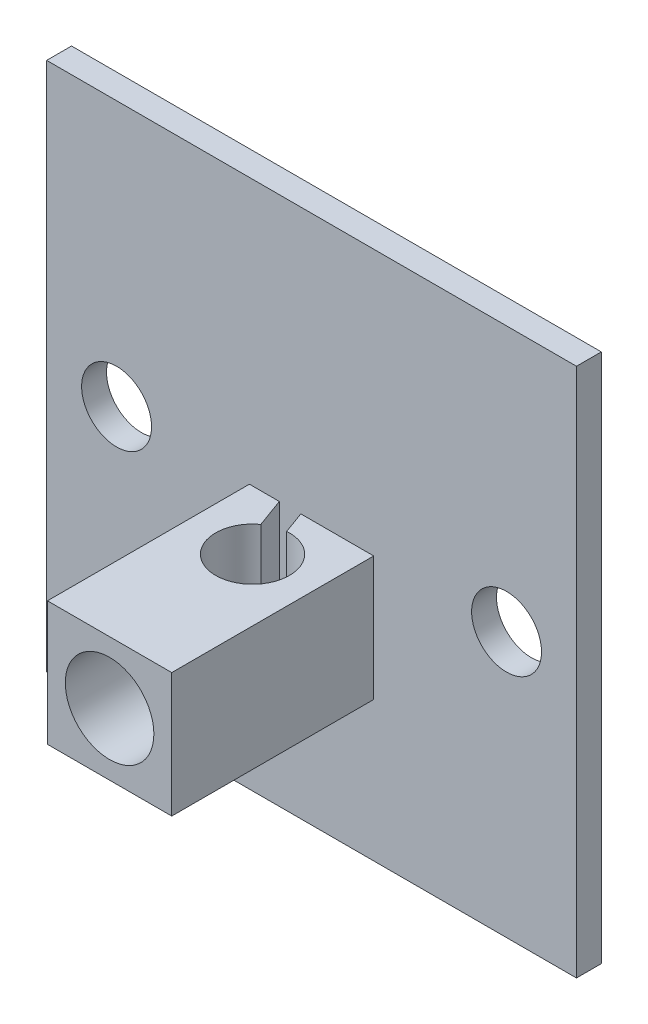
ISO-10303-21;
HEADER;
FILE_DESCRIPTION(('STEP AP214'),'2;1');
FILE_NAME('part.step','',(''),(''),'','','');
FILE_SCHEMA(('AUTOMOTIVE_DESIGN { 1 0 10303 214 1 1 1 1 }'));
ENDSEC;
DATA;
#1=APPLICATION_CONTEXT('core data for automotive mechanical design processes');
#2=APPLICATION_PROTOCOL_DEFINITION('international standard','automotive_design',2000,#1);
#3=PRODUCT_CONTEXT('',#1,'mechanical');
#4=PRODUCT('Part','Part','',(#3));
#5=PRODUCT_RELATED_PRODUCT_CATEGORY('part','',(#4));
#6=PRODUCT_DEFINITION_FORMATION('','',#4);
#7=PRODUCT_DEFINITION_CONTEXT('part definition',#1,'design');
#8=PRODUCT_DEFINITION('design','',#6,#7);
#9=PRODUCT_DEFINITION_SHAPE('','',#8);
#10=(LENGTH_UNIT() NAMED_UNIT(*) SI_UNIT(.MILLI.,.METRE.));
#11=(NAMED_UNIT(*) PLANE_ANGLE_UNIT() SI_UNIT($,.RADIAN.));
#12=(NAMED_UNIT(*) SI_UNIT($,.STERADIAN.) SOLID_ANGLE_UNIT());
#13=UNCERTAINTY_MEASURE_WITH_UNIT(LENGTH_MEASURE(1.E-05),#10,'distance_accuracy_value','');
#14=(GEOMETRIC_REPRESENTATION_CONTEXT(3) GLOBAL_UNCERTAINTY_ASSIGNED_CONTEXT((#13)) GLOBAL_UNIT_ASSIGNED_CONTEXT((#10,
#11,#12)) REPRESENTATION_CONTEXT('',''));
#15=CARTESIAN_POINT('',(0.,0.,0.));
#16=DIRECTION('',(0.,0.,1.));
#17=DIRECTION('',(1.,0.,0.));
#18=AXIS2_PLACEMENT_3D('',#15,#16,#17);
#19=CARTESIAN_POINT('',(0.,0.,1.6));
#20=DIRECTION('',(0.,0.,1.));
#21=DIRECTION('',(1.,0.,0.));
#22=AXIS2_PLACEMENT_3D('',#19,#20,#21);
#23=PLANE('',#22);
#24=DIRECTION('',(0.,1.,0.));
#25=VECTOR('',#24,1.);
#26=CARTESIAN_POINT('',(4.,-0.049999999999998,1.6));
#27=LINE('',#26,#25);
#28=CARTESIAN_POINT('',(4.,-8.05,1.6));
#29=VERTEX_POINT('',#28);
#30=CARTESIAN_POINT('',(4.,-0.049999999999998,1.6));
#31=VERTEX_POINT('',#30);
#32=EDGE_CURVE('E158',#29,#31,#27,.T.);
#33=ORIENTED_EDGE('',*,*,#32,.F.);
#34=DIRECTION('',(-1.,0.,0.));
#35=VECTOR('',#34,1.);
#36=CARTESIAN_POINT('',(17.05,-8.04999999999999,1.6));
#37=LINE('',#36,#35);
#38=CARTESIAN_POINT('',(-0.691371338102213,-8.05,1.6));
#39=VERTEX_POINT('',#38);
#40=EDGE_CURVE('E458',#29,#39,#37,.T.);
#41=ORIENTED_EDGE('',*,*,#40,.T.);
#42=DIRECTION('',(0.,1.,0.));
#43=VECTOR('',#42,1.);
#44=CARTESIAN_POINT('',(-0.691371338102214,-12.05,1.6));
#45=LINE('',#44,#43);
#46=CARTESIAN_POINT('',(-0.691371338102214,-0.049999999999998,1.6));
#47=VERTEX_POINT('',#46);
#48=EDGE_CURVE('E441',#39,#47,#45,.T.);
#49=ORIENTED_EDGE('',*,*,#48,.T.);
#50=DIRECTION('',(-1.,0.,0.));
#51=VECTOR('',#50,1.);
#52=CARTESIAN_POINT('',(-4.,-0.049999999999998,1.6));
#53=LINE('',#52,#51);
#54=EDGE_CURVE('E145',#31,#47,#53,.T.);
#55=ORIENTED_EDGE('',*,*,#54,.F.);
#56=EDGE_LOOP('',(#33,#41,#49,#55));
#57=FACE_BOUND('',#56,.T.);
#58=DIRECTION('',(0.,1.,0.));
#59=VECTOR('',#58,1.);
#60=CARTESIAN_POINT('',(-2.0748024423209,-12.05,1.6));
#61=LINE('',#60,#59);
#62=CARTESIAN_POINT('',(-2.0748024423209,-8.05,1.6));
#63=VERTEX_POINT('',#62);
#64=CARTESIAN_POINT('',(-2.0748024423209,-0.049999999999998,1.6));
#65=VERTEX_POINT('',#64);
#66=EDGE_CURVE('E439',#63,#65,#61,.T.);
#67=ORIENTED_EDGE('',*,*,#66,.F.);
#68=CARTESIAN_POINT('',(-4.,-8.05,1.6));
#69=VERTEX_POINT('',#68);
#70=EDGE_CURVE('E129',#63,#69,#37,.T.);
#71=ORIENTED_EDGE('',*,*,#70,.T.);
#72=DIRECTION('',(0.,-1.,0.));
#73=VECTOR('',#72,1.);
#74=CARTESIAN_POINT('',(-4.,-0.049999999999998,1.6));
#75=LINE('',#74,#73);
#76=CARTESIAN_POINT('',(-4.,-0.049999999999998,1.6));
#77=VERTEX_POINT('',#76);
#78=EDGE_CURVE('E137',#77,#69,#75,.T.);
#79=ORIENTED_EDGE('',*,*,#78,.F.);
#80=EDGE_CURVE('E149',#65,#77,#53,.T.);
#81=ORIENTED_EDGE('',*,*,#80,.F.);
#82=EDGE_LOOP('',(#67,#71,#79,#81));
#83=FACE_BOUND('',#82,.T.);
#84=DIRECTION('',(0.,1.,0.));
#85=VECTOR('',#84,1.);
#86=CARTESIAN_POINT('',(17.05,17.05,1.6));
#87=LINE('',#86,#85);
#88=CARTESIAN_POINT('',(17.05,-17.05,1.6));
#89=VERTEX_POINT('',#88);
#90=CARTESIAN_POINT('',(17.05,17.05,1.6));
#91=VERTEX_POINT('',#90);
#92=EDGE_CURVE('E183',#89,#91,#87,.T.);
#93=ORIENTED_EDGE('',*,*,#92,.T.);
#94=DIRECTION('',(-1.,0.,0.));
#95=VECTOR('',#94,1.);
#96=CARTESIAN_POINT('',(-17.05,17.05,1.6));
#97=LINE('',#96,#95);
#98=CARTESIAN_POINT('',(-17.05,17.05,1.6));
#99=VERTEX_POINT('',#98);
#100=EDGE_CURVE('E185',#91,#99,#97,.T.);
#101=ORIENTED_EDGE('',*,*,#100,.T.);
#102=DIRECTION('',(0.,-1.,0.));
#103=VECTOR('',#102,1.);
#104=CARTESIAN_POINT('',(-17.05,17.05,1.6));
#105=LINE('',#104,#103);
#106=CARTESIAN_POINT('',(-17.05,-17.05,1.6));
#107=VERTEX_POINT('',#106);
#108=EDGE_CURVE('E177',#99,#107,#105,.T.);
#109=ORIENTED_EDGE('',*,*,#108,.T.);
#110=DIRECTION('',(1.,0.,0.));
#111=VECTOR('',#110,1.);
#112=CARTESIAN_POINT('',(-17.05,-17.05,1.6));
#113=LINE('',#112,#111);
#114=EDGE_CURVE('E180',#107,#89,#113,.T.);
#115=ORIENTED_EDGE('',*,*,#114,.T.);
#116=EDGE_LOOP('',(#93,#101,#109,#115));
#117=FACE_BOUND('',#116,.T.);
#118=CARTESIAN_POINT('',(12.55,0.,1.6));
#119=DIRECTION('',(0.,0.,1.));
#120=DIRECTION('',(1.,0.,0.));
#121=AXIS2_PLACEMENT_3D('',#118,#119,#120);
#122=CIRCLE('',#121,2.25);
#123=CARTESIAN_POINT('',(14.8,0.,1.6));
#124=VERTEX_POINT('',#123);
#125=EDGE_CURVE('E171',#124,#124,#122,.T.);
#126=ORIENTED_EDGE('',*,*,#125,.F.);
#127=EDGE_LOOP('',(#126));
#128=FACE_BOUND('',#127,.T.);
#129=CARTESIAN_POINT('',(-12.55,0.,1.6));
#130=DIRECTION('',(0.,0.,1.));
#131=DIRECTION('',(1.,0.,0.));
#132=AXIS2_PLACEMENT_3D('',#129,#130,#131);
#133=CIRCLE('',#132,2.25);
#134=CARTESIAN_POINT('',(-10.3,0.,1.6));
#135=VERTEX_POINT('',#134);
#136=EDGE_CURVE('E165',#135,#135,#133,.T.);
#137=ORIENTED_EDGE('',*,*,#136,.F.);
#138=EDGE_LOOP('',(#137));
#139=FACE_BOUND('',#138,.T.);
#140=ADVANCED_FACE('F36',(#57,#83,#117,#128,#139),#23,.T.);
#141=CARTESIAN_POINT('',(0.,0.,0.));
#142=DIRECTION('',(0.,0.,1.));
#143=DIRECTION('',(1.,0.,0.));
#144=AXIS2_PLACEMENT_3D('',#141,#142,#143);
#145=PLANE('',#144);
#146=DIRECTION('',(0.,-1.,0.));
#147=VECTOR('',#146,1.);
#148=CARTESIAN_POINT('',(-17.05,17.05,0.));
#149=LINE('',#148,#147);
#150=CARTESIAN_POINT('',(-17.05,17.05,0.));
#151=VERTEX_POINT('',#150);
#152=CARTESIAN_POINT('',(-17.05,-17.05,0.));
#153=VERTEX_POINT('',#152);
#154=EDGE_CURVE('E174',#151,#153,#149,.T.);
#155=ORIENTED_EDGE('',*,*,#154,.F.);
#156=DIRECTION('',(-1.,0.,0.));
#157=VECTOR('',#156,1.);
#158=CARTESIAN_POINT('',(-17.05,17.05,0.));
#159=LINE('',#158,#157);
#160=CARTESIAN_POINT('',(17.05,17.05,0.));
#161=VERTEX_POINT('',#160);
#162=EDGE_CURVE('E181',#161,#151,#159,.T.);
#163=ORIENTED_EDGE('',*,*,#162,.F.);
#164=DIRECTION('',(0.,1.,0.));
#165=VECTOR('',#164,1.);
#166=CARTESIAN_POINT('',(17.05,17.05,0.));
#167=LINE('',#166,#165);
#168=CARTESIAN_POINT('',(17.05,-17.05,0.));
#169=VERTEX_POINT('',#168);
#170=EDGE_CURVE('E192',#169,#161,#167,.T.);
#171=ORIENTED_EDGE('',*,*,#170,.F.);
#172=DIRECTION('',(1.,0.,0.));
#173=VECTOR('',#172,1.);
#174=CARTESIAN_POINT('',(-17.05,-17.05,0.));
#175=LINE('',#174,#173);
#176=EDGE_CURVE('E190',#153,#169,#175,.T.);
#177=ORIENTED_EDGE('',*,*,#176,.F.);
#178=EDGE_LOOP('',(#155,#163,#171,#177));
#179=FACE_BOUND('',#178,.T.);
#180=CARTESIAN_POINT('',(12.55,0.,0.));
#181=DIRECTION('',(0.,0.,1.));
#182=DIRECTION('',(1.,0.,0.));
#183=AXIS2_PLACEMENT_3D('',#180,#181,#182);
#184=CIRCLE('',#183,2.25);
#185=CARTESIAN_POINT('',(14.8,0.,0.));
#186=VERTEX_POINT('',#185);
#187=EDGE_CURVE('E168',#186,#186,#184,.T.);
#188=ORIENTED_EDGE('',*,*,#187,.T.);
#189=EDGE_LOOP('',(#188));
#190=FACE_BOUND('',#189,.T.);
#191=CARTESIAN_POINT('',(-12.55,0.,0.));
#192=DIRECTION('',(0.,0.,1.));
#193=DIRECTION('',(1.,0.,0.));
#194=AXIS2_PLACEMENT_3D('',#191,#192,#193);
#195=CIRCLE('',#194,2.25);
#196=CARTESIAN_POINT('',(-10.3,0.,0.));
#197=VERTEX_POINT('',#196);
#198=EDGE_CURVE('E164',#197,#197,#195,.T.);
#199=ORIENTED_EDGE('',*,*,#198,.T.);
#200=EDGE_LOOP('',(#199));
#201=FACE_BOUND('',#200,.T.);
#202=ADVANCED_FACE('F213',(#179,#190,#201),#145,.F.);
#203=CARTESIAN_POINT('',(-17.05,17.05,1.6));
#204=DIRECTION('',(1.,0.,0.));
#205=DIRECTION('',(0.,0.,-1.));
#206=AXIS2_PLACEMENT_3D('',#203,#204,#205);
#207=PLANE('',#206);
#208=ORIENTED_EDGE('',*,*,#154,.T.);
#209=DIRECTION('',(0.,0.,-1.));
#210=VECTOR('',#209,1.);
#211=CARTESIAN_POINT('',(-17.05,-17.05,1.6));
#212=LINE('',#211,#210);
#213=EDGE_CURVE('E44',#107,#153,#212,.T.);
#214=ORIENTED_EDGE('',*,*,#213,.F.);
#215=ORIENTED_EDGE('',*,*,#108,.F.);
#216=DIRECTION('',(0.,0.,-1.));
#217=VECTOR('',#216,1.);
#218=CARTESIAN_POINT('',(-17.05,17.05,1.6));
#219=LINE('',#218,#217);
#220=EDGE_CURVE('E187',#99,#151,#219,.T.);
#221=ORIENTED_EDGE('',*,*,#220,.T.);
#222=EDGE_LOOP('',(#208,#214,#215,#221));
#223=FACE_BOUND('',#222,.T.);
#224=ADVANCED_FACE('F38',(#223),#207,.F.);
#225=CARTESIAN_POINT('',(-17.05,-17.05,1.6));
#226=DIRECTION('',(0.,1.,0.));
#227=DIRECTION('',(0.,0.,1.));
#228=AXIS2_PLACEMENT_3D('',#225,#226,#227);
#229=PLANE('',#228);
#230=DIRECTION('',(0.,0.,-1.));
#231=VECTOR('',#230,1.);
#232=CARTESIAN_POINT('',(17.05,-17.05,1.6));
#233=LINE('',#232,#231);
#234=EDGE_CURVE('E200',#89,#169,#233,.T.);
#235=ORIENTED_EDGE('',*,*,#234,.F.);
#236=ORIENTED_EDGE('',*,*,#114,.F.);
#237=ORIENTED_EDGE('',*,*,#213,.T.);
#238=ORIENTED_EDGE('',*,*,#176,.T.);
#239=EDGE_LOOP('',(#235,#236,#237,#238));
#240=FACE_BOUND('',#239,.T.);
#241=ADVANCED_FACE('F206',(#240),#229,.F.);
#242=CARTESIAN_POINT('',(17.05,17.05,1.6));
#243=DIRECTION('',(-1.,0.,0.));
#244=DIRECTION('',(0.,0.,1.));
#245=AXIS2_PLACEMENT_3D('',#242,#243,#244);
#246=PLANE('',#245);
#247=ORIENTED_EDGE('',*,*,#170,.T.);
#248=DIRECTION('',(0.,0.,-1.));
#249=VECTOR('',#248,1.);
#250=CARTESIAN_POINT('',(17.05,17.05,1.6));
#251=LINE('',#250,#249);
#252=EDGE_CURVE('E197',#91,#161,#251,.T.);
#253=ORIENTED_EDGE('',*,*,#252,.F.);
#254=ORIENTED_EDGE('',*,*,#92,.F.);
#255=ORIENTED_EDGE('',*,*,#234,.T.);
#256=EDGE_LOOP('',(#247,#253,#254,#255));
#257=FACE_BOUND('',#256,.T.);
#258=ADVANCED_FACE('F218',(#257),#246,.F.);
#259=CARTESIAN_POINT('',(-17.05,17.05,1.6));
#260=DIRECTION('',(0.,-1.,0.));
#261=DIRECTION('',(0.,0.,-1.));
#262=AXIS2_PLACEMENT_3D('',#259,#260,#261);
#263=PLANE('',#262);
#264=ORIENTED_EDGE('',*,*,#162,.T.);
#265=ORIENTED_EDGE('',*,*,#220,.F.);
#266=ORIENTED_EDGE('',*,*,#100,.F.);
#267=ORIENTED_EDGE('',*,*,#252,.T.);
#268=EDGE_LOOP('',(#264,#265,#266,#267));
#269=FACE_BOUND('',#268,.T.);
#270=ADVANCED_FACE('F222',(#269),#263,.F.);
#271=CARTESIAN_POINT('',(12.55,0.,1.6));
#272=DIRECTION('',(0.,0.,-1.));
#273=DIRECTION('',(-1.,0.,0.));
#274=AXIS2_PLACEMENT_3D('',#271,#272,#273);
#275=CYLINDRICAL_SURFACE('',#274,2.25);
#276=ORIENTED_EDGE('',*,*,#125,.T.);
#277=EDGE_LOOP('',(#276));
#278=FACE_BOUND('',#277,.T.);
#279=ORIENTED_EDGE('',*,*,#187,.F.);
#280=EDGE_LOOP('',(#279));
#281=FACE_BOUND('',#280,.T.);
#282=ADVANCED_FACE('F235',(#278,#281),#275,.F.);
#283=CARTESIAN_POINT('',(-12.55,0.,1.6));
#284=DIRECTION('',(0.,0.,-1.));
#285=DIRECTION('',(-1.,0.,0.));
#286=AXIS2_PLACEMENT_3D('',#283,#284,#285);
#287=CYLINDRICAL_SURFACE('',#286,2.25);
#288=ORIENTED_EDGE('',*,*,#136,.T.);
#289=EDGE_LOOP('',(#288));
#290=FACE_BOUND('',#289,.T.);
#291=ORIENTED_EDGE('',*,*,#198,.F.);
#292=EDGE_LOOP('',(#291));
#293=FACE_BOUND('',#292,.T.);
#294=ADVANCED_FACE('F232',(#290,#293),#287,.F.);
#295=CARTESIAN_POINT('',(-4.,-0.049999999999998,14.6));
#296=DIRECTION('',(1.,0.,0.));
#297=DIRECTION('',(0.,1.,0.));
#298=AXIS2_PLACEMENT_3D('',#295,#296,#297);
#299=PLANE('',#298);
#300=ORIENTED_EDGE('',*,*,#78,.T.);
#301=DIRECTION('',(0.,0.,-1.));
#302=VECTOR('',#301,1.);
#303=CARTESIAN_POINT('',(-4.,-8.05,14.6));
#304=LINE('',#303,#302);
#305=CARTESIAN_POINT('',(-4.,-8.05,14.6));
#306=VERTEX_POINT('',#305);
#307=EDGE_CURVE('E124',#306,#69,#304,.T.);
#308=ORIENTED_EDGE('',*,*,#307,.F.);
#309=DIRECTION('',(0.,-1.,0.));
#310=VECTOR('',#309,1.);
#311=CARTESIAN_POINT('',(-4.,-0.049999999999998,14.6));
#312=LINE('',#311,#310);
#313=CARTESIAN_POINT('',(-4.,-0.049999999999998,14.6));
#314=VERTEX_POINT('',#313);
#315=EDGE_CURVE('E135',#314,#306,#312,.T.);
#316=ORIENTED_EDGE('',*,*,#315,.F.);
#317=DIRECTION('',(0.,0.,-1.));
#318=VECTOR('',#317,1.);
#319=CARTESIAN_POINT('',(-4.,-0.049999999999998,14.6));
#320=LINE('',#319,#318);
#321=EDGE_CURVE('E156',#314,#77,#320,.T.);
#322=ORIENTED_EDGE('',*,*,#321,.T.);
#323=EDGE_LOOP('',(#300,#308,#316,#322));
#324=FACE_BOUND('',#323,.T.);
#325=ADVANCED_FACE('F133',(#324),#299,.F.);
#326=CARTESIAN_POINT('',(4.,-0.049999999999998,14.6));
#327=DIRECTION('',(-1.,0.,0.));
#328=DIRECTION('',(0.,-1.,0.));
#329=AXIS2_PLACEMENT_3D('',#326,#327,#328);
#330=PLANE('',#329);
#331=DIRECTION('',(0.,1.,0.));
#332=VECTOR('',#331,1.);
#333=CARTESIAN_POINT('',(4.,-0.049999999999998,14.6));
#334=LINE('',#333,#332);
#335=CARTESIAN_POINT('',(4.,-8.05,14.6));
#336=VERTEX_POINT('',#335);
#337=CARTESIAN_POINT('',(4.,-0.049999999999998,14.6));
#338=VERTEX_POINT('',#337);
#339=EDGE_CURVE('E144',#336,#338,#334,.T.);
#340=ORIENTED_EDGE('',*,*,#339,.F.);
#341=DIRECTION('',(0.,0.,-1.));
#342=VECTOR('',#341,1.);
#343=CARTESIAN_POINT('',(4.,-8.04999999999999,14.6));
#344=LINE('',#343,#342);
#345=EDGE_CURVE('E51',#336,#29,#344,.T.);
#346=ORIENTED_EDGE('',*,*,#345,.T.);
#347=ORIENTED_EDGE('',*,*,#32,.T.);
#348=DIRECTION('',(0.,0.,-1.));
#349=VECTOR('',#348,1.);
#350=CARTESIAN_POINT('',(4.,-0.049999999999998,14.6));
#351=LINE('',#350,#349);
#352=EDGE_CURVE('E161',#338,#31,#351,.T.);
#353=ORIENTED_EDGE('',*,*,#352,.F.);
#354=EDGE_LOOP('',(#340,#346,#347,#353));
#355=FACE_BOUND('',#354,.T.);
#356=ADVANCED_FACE('F280',(#355),#330,.F.);
#357=CARTESIAN_POINT('',(-4.,-0.049999999999998,14.6));
#358=DIRECTION('',(0.,-1.,0.));
#359=DIRECTION('',(0.,0.,-1.));
#360=AXIS2_PLACEMENT_3D('',#357,#358,#359);
#361=PLANE('',#360);
#362=CARTESIAN_POINT('',(0.,-0.049999999999998,5.4));
#363=DIRECTION('',(0.,1.,0.));
#364=DIRECTION('',(0.,0.,1.));
#365=AXIS2_PLACEMENT_3D('',#362,#363,#364);
#366=CIRCLE('',#365,2.375);
#367=CARTESIAN_POINT('',(-1.39208419165144,-0.049999999999998,3.47575297756391));
#368=VERTEX_POINT('',#367);
#369=CARTESIAN_POINT('',(-0.170483784629758,-0.049999999999998,3.03112679124055));
#370=VERTEX_POINT('',#369);
#371=EDGE_CURVE('E152',#368,#370,#366,.T.);
#372=ORIENTED_EDGE('',*,*,#371,.F.);
#373=DIRECTION('',(0.342020143325666,0.,0.939692620785909));
#374=VECTOR('',#373,1.);
#375=CARTESIAN_POINT('',(-1.39208419165144,-0.049999999999998,3.47575297756391));
#376=LINE('',#375,#374);
#377=EDGE_CURVE('E433',#65,#368,#376,.T.);
#378=ORIENTED_EDGE('',*,*,#377,.F.);
#379=ORIENTED_EDGE('',*,*,#80,.T.);
#380=ORIENTED_EDGE('',*,*,#321,.F.);
#381=DIRECTION('',(-1.,0.,0.));
#382=VECTOR('',#381,1.);
#383=CARTESIAN_POINT('',(-4.,-0.049999999999998,14.6));
#384=LINE('',#383,#382);
#385=EDGE_CURVE('E142',#338,#314,#384,.T.);
#386=ORIENTED_EDGE('',*,*,#385,.F.);
#387=ORIENTED_EDGE('',*,*,#352,.T.);
#388=ORIENTED_EDGE('',*,*,#54,.T.);
#389=DIRECTION('',(-0.342020143325666,0.,-0.939692620785909));
#390=VECTOR('',#389,1.);
#391=CARTESIAN_POINT('',(-0.170483784629758,-0.049999999999998,3.03112679124055));
#392=LINE('',#391,#390);
#393=EDGE_CURVE('E428',#370,#47,#392,.T.);
#394=ORIENTED_EDGE('',*,*,#393,.F.);
#395=EDGE_LOOP('',(#372,#378,#379,#380,#386,#387,#388,#394));
#396=FACE_BOUND('',#395,.T.);
#397=ADVANCED_FACE('F287',(#396),#361,.F.);
#398=CARTESIAN_POINT('',(0.,0.,14.6));
#399=DIRECTION('',(0.,0.,1.));
#400=DIRECTION('',(1.,0.,0.));
#401=AXIS2_PLACEMENT_3D('',#398,#399,#400);
#402=PLANE('',#401);
#403=DIRECTION('',(-1.,0.,0.));
#404=VECTOR('',#403,1.);
#405=CARTESIAN_POINT('',(17.05,-8.04999999999999,14.6));
#406=LINE('',#405,#404);
#407=EDGE_CURVE('E121',#336,#306,#406,.T.);
#408=ORIENTED_EDGE('',*,*,#407,.F.);
#409=ORIENTED_EDGE('',*,*,#339,.T.);
#410=ORIENTED_EDGE('',*,*,#385,.T.);
#411=ORIENTED_EDGE('',*,*,#315,.T.);
#412=EDGE_LOOP('',(#408,#409,#410,#411));
#413=FACE_BOUND('',#412,.T.);
#414=CARTESIAN_POINT('',(0.,-4.05,14.6));
#415=DIRECTION('',(0.,0.,1.));
#416=DIRECTION('',(1.,0.,0.));
#417=AXIS2_PLACEMENT_3D('',#414,#415,#416);
#418=CIRCLE('',#417,2.85);
#419=CARTESIAN_POINT('',(2.85,-4.05,14.6));
#420=VERTEX_POINT('',#419);
#421=EDGE_CURVE('E422',#420,#420,#418,.T.);
#422=ORIENTED_EDGE('',*,*,#421,.F.);
#423=EDGE_LOOP('',(#422));
#424=FACE_BOUND('',#423,.T.);
#425=ADVANCED_FACE('F139',(#413,#424),#402,.T.);
#426=CARTESIAN_POINT('',(0.,-17.05,5.4));
#427=DIRECTION('',(0.,1.,0.));
#428=DIRECTION('',(0.,0.,1.));
#429=AXIS2_PLACEMENT_3D('',#426,#427,#428);
#430=CYLINDRICAL_SURFACE('',#429,2.375);
#431=CARTESIAN_POINT('',(1.85,-4.05,6.88933710086065));
#432=CARTESIAN_POINT('',(1.84999783990807,-4.1348206714518,6.88934180760913));
#433=CARTESIAN_POINT('',(1.84409358367015,-4.2196506262038,6.89676184528267));
#434=CARTESIAN_POINT('',(1.82122173689108,-4.38578388626016,6.9244901061442));
#435=CARTESIAN_POINT('',(1.8042084838502,-4.46707115206844,6.94485151440003));
#436=CARTESIAN_POINT('',(1.75575084111101,-4.64140437234642,6.99986373552892));
#437=CARTESIAN_POINT('',(1.72194648945356,-4.73307315470757,7.03667927863424));
#438=CARTESIAN_POINT('',(1.64201248345971,-4.90763450045086,7.11686810442882));
#439=CARTESIAN_POINT('',(1.59586829947558,-4.99051655612346,7.16024909135264));
#440=CARTESIAN_POINT('',(1.49074170506662,-5.14978855891225,7.25020001002887));
#441=CARTESIAN_POINT('',(1.43143943733703,-5.22593546322199,7.29682496253667));
#442=CARTESIAN_POINT('',(1.30119921328725,-5.36859575984497,7.38842741130608));
#443=CARTESIAN_POINT('',(1.23026996535386,-5.43511629245152,7.43340610997118));
#444=CARTESIAN_POINT('',(1.08047691266675,-5.55460147752645,7.51664979956419));
#445=CARTESIAN_POINT('',(1.0021128410296,-5.60804093592304,7.55512564767243));
#446=CARTESIAN_POINT('',(0.835680976201304,-5.70326937849394,7.62494443531674));
#447=CARTESIAN_POINT('',(0.747622540878178,-5.74506946280398,7.65629416554807));
#448=CARTESIAN_POINT('',(0.577529051594057,-5.80952178703611,7.70514063056678));
#449=CARTESIAN_POINT('',(0.496636775371476,-5.83412605761589,7.72402361665338));
#450=CARTESIAN_POINT('',(0.330790110517031,-5.8721691003751,7.75335436351233));
#451=CARTESIAN_POINT('',(0.245838399610361,-5.88561512821591,7.76380760561126));
#452=CARTESIAN_POINT('',(0.0739852023732411,-5.90053637634662,7.77541310162335));
#453=CARTESIAN_POINT('',(-0.0129213453157247,-5.90197575885616,7.77653751051313));
#454=CARTESIAN_POINT('',(-0.185683159473771,-5.89269015990958,7.76930869975123));
#455=CARTESIAN_POINT('',(-0.271538282544344,-5.88196353746424,7.76095420155454));
#456=CARTESIAN_POINT('',(-0.435821628939204,-5.84979306363137,7.73608269770747));
#457=CARTESIAN_POINT('',(-0.514410155442283,-5.82885509549461,7.71995136227616));
#458=CARTESIAN_POINT('',(-0.666637651949515,-5.77758556132948,7.68087748479692));
#459=CARTESIAN_POINT('',(-0.740275452769682,-5.74725178576628,7.65793334068931));
#460=CARTESIAN_POINT('',(-0.888853775670697,-5.67479652657745,7.6039607440855));
#461=CARTESIAN_POINT('',(-0.963138656027942,-5.63177930822085,7.57234095567814));
#462=CARTESIAN_POINT('',(-1.10365579201075,-5.53715547831429,7.50444062916282));
#463=CARTESIAN_POINT('',(-1.16988237739537,-5.48554287840033,7.46815684571943));
#464=CARTESIAN_POINT('',(-1.30661032018919,-5.36350681330286,7.38519979549211));
#465=CARTESIAN_POINT('',(-1.37523181782592,-5.29139343089225,7.33791625109851));
#466=CARTESIAN_POINT('',(-1.50008817339368,-5.13724028270745,7.24296128372458));
#467=CARTESIAN_POINT('',(-1.55631195542133,-5.05519174157915,7.19528955304779));
#468=CARTESIAN_POINT('',(-1.64797696733436,-4.89488203109188,7.11115327474597));
#469=CARTESIAN_POINT('',(-1.68528860750559,-4.81800433252179,7.07409681117988));
#470=CARTESIAN_POINT('',(-1.74961364824385,-4.65729440659268,7.00674858330104));
#471=CARTESIAN_POINT('',(-1.77664999096434,-4.57347818729547,6.97644181206278));
#472=CARTESIAN_POINT('',(-1.81357757555845,-4.42138144379641,6.93367464743322));
#473=CARTESIAN_POINT('',(-1.82606801346904,-4.35447524182897,6.91864483949387));
#474=CARTESIAN_POINT('',(-1.84359387517057,-4.21836900917216,6.89732624628823));
#475=CARTESIAN_POINT('',(-1.84864277335188,-4.14917335694359,6.89102166353011));
#476=CARTESIAN_POINT('',(-1.8508804223997,-4.01022491480367,6.88824471256529));
#477=CARTESIAN_POINT('',(-1.84804424329885,-3.94047105466939,6.89180352900535));
#478=CARTESIAN_POINT('',(-1.8347165103984,-3.8027751340584,6.90815867131037));
#479=CARTESIAN_POINT('',(-1.82421330908199,-3.73483599341441,6.92096905156578));
#480=CARTESIAN_POINT('',(-1.79187829370487,-3.5813644832742,6.95903436156553));
#481=CARTESIAN_POINT('',(-1.76751809095729,-3.49704253085983,6.9869401223576));
#482=CARTESIAN_POINT('',(-1.70847028461279,-3.33508325146757,7.0503434319095));
#483=CARTESIAN_POINT('',(-1.67375140208658,-3.25746710193005,7.0858638811094));
#484=CARTESIAN_POINT('',(-1.58054221843201,-3.08169959370464,7.1742606943274));
#485=CARTESIAN_POINT('',(-1.51800513965359,-2.98648860909218,7.22871701536627));
#486=CARTESIAN_POINT('',(-1.37665945853149,-2.80896872902534,7.33737072157247));
#487=CARTESIAN_POINT('',(-1.29785737400872,-2.72665468859336,7.39156820159065));
#488=CARTESIAN_POINT('',(-1.13861366614772,-2.58875074357782,7.48597734061728));
#489=CARTESIAN_POINT('',(-1.06055431500152,-2.53099194240037,7.52702581432387));
#490=CARTESIAN_POINT('',(-0.893950660590982,-2.42736670377036,7.60222474428387));
#491=CARTESIAN_POINT('',(-0.805423634727175,-2.38148105753053,7.63638632235245));
#492=CARTESIAN_POINT('',(-0.634879632505444,-2.31032152820014,7.69001286648211));
#493=CARTESIAN_POINT('',(-0.554241979846583,-2.28288574285544,7.71097908785873));
#494=CARTESIAN_POINT('',(-0.388309816284314,-2.23918243441976,7.74456557741303));
#495=CARTESIAN_POINT('',(-0.303017914925948,-2.22290872104143,7.75719047140018));
#496=CARTESIAN_POINT('',(-0.129784542309513,-2.20249169415969,7.77305075965342));
#497=CARTESIAN_POINT('',(-0.0418344273674404,-2.19839353401111,7.77625120271245));
#498=CARTESIAN_POINT('',(0.133562895783301,-2.20274368289937,7.77286301871481));
#499=CARTESIAN_POINT('',(0.221010102210589,-2.21119203635049,7.766274357005));
#500=CARTESIAN_POINT('',(0.387538049042172,-2.23919230390187,7.74458479155111));
#501=CARTESIAN_POINT('',(0.466807309192571,-2.25805543892981,7.7300123159068));
#502=CARTESIAN_POINT('',(0.62070485092996,-2.30537598341293,7.69381913698379));
#503=CARTESIAN_POINT('',(0.69533202776708,-2.33383566644138,7.67219676351352));
#504=CARTESIAN_POINT('',(0.845128585486651,-2.40208485229821,7.6210789614885));
#505=CARTESIAN_POINT('',(0.919757761261796,-2.44265596907649,7.59105494415472));
#506=CARTESIAN_POINT('',(1.06130096166971,-2.53237901542663,7.52610921166448));
#507=CARTESIAN_POINT('',(1.12821043763798,-2.5815359615648,7.49118463554666));
#508=CARTESIAN_POINT('',(1.26641935979934,-2.69782300937658,7.41106516855343));
#509=CARTESIAN_POINT('',(1.33595966110095,-2.76658429053593,7.36520678358814));
#510=CARTESIAN_POINT('',(1.46320212419657,-2.91376835296974,7.27239576327853));
#511=CARTESIAN_POINT('',(1.5208921908334,-2.99220087602983,7.22544206386239));
#512=CARTESIAN_POINT('',(1.61922503221815,-3.15082648170685,7.1385730104393));
#513=CARTESIAN_POINT('',(1.6609394577792,-3.23021454012936,7.09840555347516));
#514=CARTESIAN_POINT('',(1.73321629877526,-3.39679301170625,7.02457604681311));
#515=CARTESIAN_POINT('',(1.76379354789003,-3.48397285264558,6.99090537234121));
#516=CARTESIAN_POINT('',(1.80799719464516,-3.65033106264549,6.94036303107617));
#517=CARTESIAN_POINT('',(1.82361193457802,-3.72838154460034,6.9216164874363));
#518=CARTESIAN_POINT('',(1.84459636439395,-3.88762657362922,6.89612235614984));
#519=CARTESIAN_POINT('',(1.85000206765577,-3.96880903392211,6.88933259552663));
#520=CARTESIAN_POINT('',(1.85,-4.05,6.88933710086065));
#521=B_SPLINE_CURVE_WITH_KNOTS('',3,(#431,#432,#433,#434,#435,#436,#437,#438,#439,#440,#441,
#442,#443,#444,#445,#446,#447,#448,#449,#450,#451,#452,#453,#454,#455,#456,#457,#458,#459,#460,
#461,#462,#463,#464,#465,#466,#467,#468,#469,#470,#471,#472,#473,#474,#475,#476,#477,#478,#479,
#480,#481,#482,#483,#484,#485,#486,#487,#488,#489,#490,#491,#492,#493,#494,#495,#496,#497,#498,
#499,#500,#501,#502,#503,#504,#505,#506,#507,#508,#509,#510,#511,#512,#513,#514,#515,#516,#517,
#518,#519,#520),.UNSPECIFIED.,.T.,.F.,(4,2,2,2,2,2,2,2,2,2,2,2,2,2,2,2,2,2,2,2,2,2,2,2,2,2,2,2,
2,2,2,2,2,2,2,2,2,2,2,2,2,2,2,2,4),(0.,0.254030160515403,0.509111117780176,0.820624978565364,
1.13250726163135,1.45301789918307,1.77328956810066,2.07917035075351,2.38475841677091,
2.6435477883516,2.90216874966605,3.16156137506194,3.42098899231664,3.66870048001903,
3.91647026427908,4.18991347333038,4.46354799219084,4.79295373240733,5.12265257628975,
5.4012588042952,5.67923926823381,5.88751711859384,6.09541737511203,6.30397568929108,
6.5128515003144,6.78761441996385,7.06321555459621,7.440134194584,7.81690208546217,
8.13196334011384,8.44651164537562,8.70856352244774,8.97046995242976,9.23334646425821,
9.49622390666369,9.74349905004531,9.99083281800941,10.2601275810399,10.5295802183985,
10.8524483014309,11.1756443058859,11.4695240661736,11.7630109622017,12.0070329178467,
12.2501924424313),.UNSPECIFIED.);
#522=CARTESIAN_POINT('',(1.85,-4.05,6.88933710086065));
#523=VERTEX_POINT('',#522);
#524=EDGE_CURVE('E415',#523,#523,#521,.T.);
#525=ORIENTED_EDGE('',*,*,#524,.F.);
#526=EDGE_LOOP('',(#525));
#527=FACE_BOUND('',#526,.T.);
#528=DIRECTION('',(0.,1.,0.));
#529=VECTOR('',#528,1.);
#530=CARTESIAN_POINT('',(-0.170483784629758,-12.05,3.03112679124055));
#531=LINE('',#530,#529);
#532=CARTESIAN_POINT('',(-0.170483784629758,-8.05,3.03112679124055));
#533=VERTEX_POINT('',#532);
#534=EDGE_CURVE('E436',#533,#370,#531,.T.);
#535=ORIENTED_EDGE('',*,*,#534,.F.);
#536=CARTESIAN_POINT('',(0.,-8.05,5.4));
#537=DIRECTION('',(0.,1.,0.));
#538=DIRECTION('',(-1.,0.,0.));
#539=AXIS2_PLACEMENT_3D('',#536,#537,#538);
#540=CIRCLE('',#539,2.375);
#541=CARTESIAN_POINT('',(-1.39208419165144,-8.05,3.47575297756391));
#542=VERTEX_POINT('',#541);
#543=EDGE_CURVE('E58',#533,#542,#540,.F.);
#544=ORIENTED_EDGE('',*,*,#543,.T.);
#545=DIRECTION('',(0.,1.,0.));
#546=VECTOR('',#545,1.);
#547=CARTESIAN_POINT('',(-1.39208419165144,-12.05,3.47575297756391));
#548=LINE('',#547,#546);
#549=EDGE_CURVE('E437',#542,#368,#548,.T.);
#550=ORIENTED_EDGE('',*,*,#549,.T.);
#551=ORIENTED_EDGE('',*,*,#371,.T.);
#552=EDGE_LOOP('',(#535,#544,#550,#551));
#553=FACE_BOUND('',#552,.T.);
#554=ADVANCED_FACE('F302',(#527,#553),#430,.F.);
#555=CARTESIAN_POINT('',(-1.39208419165144,-12.05,3.47575297756391));
#556=DIRECTION('',(-0.939692620785909,0.,0.342020143325666));
#557=DIRECTION('',(0.342020143325666,0.,0.939692620785909));
#558=AXIS2_PLACEMENT_3D('',#555,#556,#557);
#559=PLANE('',#558);
#560=ORIENTED_EDGE('',*,*,#549,.F.);
#561=DIRECTION('',(-0.342020143325666,0.,-0.939692620785909));
#562=VECTOR('',#561,1.);
#563=CARTESIAN_POINT('',(-1.39208419165144,-8.05,3.47575297756391));
#564=LINE('',#563,#562);
#565=EDGE_CURVE('E460',#542,#63,#564,.T.);
#566=ORIENTED_EDGE('',*,*,#565,.T.);
#567=ORIENTED_EDGE('',*,*,#66,.T.);
#568=ORIENTED_EDGE('',*,*,#377,.T.);
#569=EDGE_LOOP('',(#560,#566,#567,#568));
#570=FACE_BOUND('',#569,.T.);
#571=ADVANCED_FACE('F309',(#570),#559,.F.);
#572=CARTESIAN_POINT('',(-0.170483784629758,-12.05,3.03112679124055));
#573=DIRECTION('',(0.939692620785909,0.,-0.342020143325666));
#574=DIRECTION('',(-0.342020143325666,0.,-0.939692620785909));
#575=AXIS2_PLACEMENT_3D('',#572,#573,#574);
#576=PLANE('',#575);
#577=ORIENTED_EDGE('',*,*,#48,.F.);
#578=DIRECTION('',(0.342020143325666,0.,0.939692620785909));
#579=VECTOR('',#578,1.);
#580=CARTESIAN_POINT('',(-0.170483784629758,-8.05,3.03112679124054));
#581=LINE('',#580,#579);
#582=EDGE_CURVE('E11',#39,#533,#581,.T.);
#583=ORIENTED_EDGE('',*,*,#582,.T.);
#584=ORIENTED_EDGE('',*,*,#534,.T.);
#585=ORIENTED_EDGE('',*,*,#393,.T.);
#586=EDGE_LOOP('',(#577,#583,#584,#585));
#587=FACE_BOUND('',#586,.T.);
#588=ADVANCED_FACE('F317',(#587),#576,.F.);
#589=CARTESIAN_POINT('',(0.,-4.05,8.9));
#590=DIRECTION('',(0.,0.,1.));
#591=DIRECTION('',(1.,0.,0.));
#592=AXIS2_PLACEMENT_3D('',#589,#590,#591);
#593=CYLINDRICAL_SURFACE('',#592,2.85);
#594=CARTESIAN_POINT('',(0.,-4.05,8.9));
#595=DIRECTION('',(0.,0.,1.));
#596=DIRECTION('',(1.,0.,0.));
#597=AXIS2_PLACEMENT_3D('',#594,#595,#596);
#598=CIRCLE('',#597,2.85);
#599=CARTESIAN_POINT('',(2.85,-4.05,8.9));
#600=VERTEX_POINT('',#599);
#601=EDGE_CURVE('E425',#600,#600,#598,.T.);
#602=ORIENTED_EDGE('',*,*,#601,.F.);
#603=EDGE_LOOP('',(#602));
#604=FACE_BOUND('',#603,.T.);
#605=ORIENTED_EDGE('',*,*,#421,.T.);
#606=EDGE_LOOP('',(#605));
#607=FACE_BOUND('',#606,.T.);
#608=ADVANCED_FACE('F325',(#604,#607),#593,.F.);
#609=CARTESIAN_POINT('',(0.,-4.05,8.9));
#610=DIRECTION('',(0.,0.,1.));
#611=DIRECTION('',(1.,0.,0.));
#612=AXIS2_PLACEMENT_3D('',#609,#610,#611);
#613=PLANE('',#612);
#614=CARTESIAN_POINT('',(0.,-4.05,8.9));
#615=DIRECTION('',(0.,0.,1.));
#616=DIRECTION('',(1.,0.,0.));
#617=AXIS2_PLACEMENT_3D('',#614,#615,#616);
#618=CIRCLE('',#617,1.85);
#619=CARTESIAN_POINT('',(1.85,-4.05,8.9));
#620=VERTEX_POINT('',#619);
#621=EDGE_CURVE('E423',#620,#620,#618,.T.);
#622=ORIENTED_EDGE('',*,*,#621,.F.);
#623=EDGE_LOOP('',(#622));
#624=FACE_BOUND('',#623,.T.);
#625=ORIENTED_EDGE('',*,*,#601,.T.);
#626=EDGE_LOOP('',(#625));
#627=FACE_BOUND('',#626,.T.);
#628=ADVANCED_FACE('F333',(#624,#627),#613,.T.);
#629=CARTESIAN_POINT('',(0.,-4.05,-0.000999999999999265));
#630=DIRECTION('',(0.,0.,1.));
#631=DIRECTION('',(1.,0.,0.));
#632=AXIS2_PLACEMENT_3D('',#629,#630,#631);
#633=CYLINDRICAL_SURFACE('',#632,1.85);
#634=ORIENTED_EDGE('',*,*,#621,.T.);
#635=EDGE_LOOP('',(#634));
#636=FACE_BOUND('',#635,.T.);
#637=ORIENTED_EDGE('',*,*,#524,.T.);
#638=EDGE_LOOP('',(#637));
#639=FACE_BOUND('',#638,.T.);
#640=ADVANCED_FACE('F341',(#636,#639),#633,.F.);
#641=CARTESIAN_POINT('',(17.05,-8.04999999999999,14.6));
#642=DIRECTION('',(0.,1.,0.));
#643=DIRECTION('',(-1.,0.,0.));
#644=AXIS2_PLACEMENT_3D('',#641,#642,#643);
#645=PLANE('',#644);
#646=ORIENTED_EDGE('',*,*,#407,.T.);
#647=ORIENTED_EDGE('',*,*,#307,.T.);
#648=ORIENTED_EDGE('',*,*,#70,.F.);
#649=ORIENTED_EDGE('',*,*,#565,.F.);
#650=ORIENTED_EDGE('',*,*,#543,.F.);
#651=ORIENTED_EDGE('',*,*,#582,.F.);
#652=ORIENTED_EDGE('',*,*,#40,.F.);
#653=ORIENTED_EDGE('',*,*,#345,.F.);
#654=EDGE_LOOP('',(#646,#647,#648,#649,#650,#651,#652,#653));
#655=FACE_BOUND('',#654,.T.);
#656=ADVANCED_FACE('F123',(#655),#645,.F.);
#657=CLOSED_SHELL('',(#140,#202,#224,#241,#258,#270,#282,#294,#325,#356,#397,#425,#554,#571,
#588,#608,#628,#640,#656));
#658=MANIFOLD_SOLID_BREP('B2',#657);
#659=ADVANCED_BREP_SHAPE_REPRESENTATION('',(#18,#658),#14);
#660=SHAPE_DEFINITION_REPRESENTATION(#9,#659);
ENDSEC;
END-ISO-10303-21;
